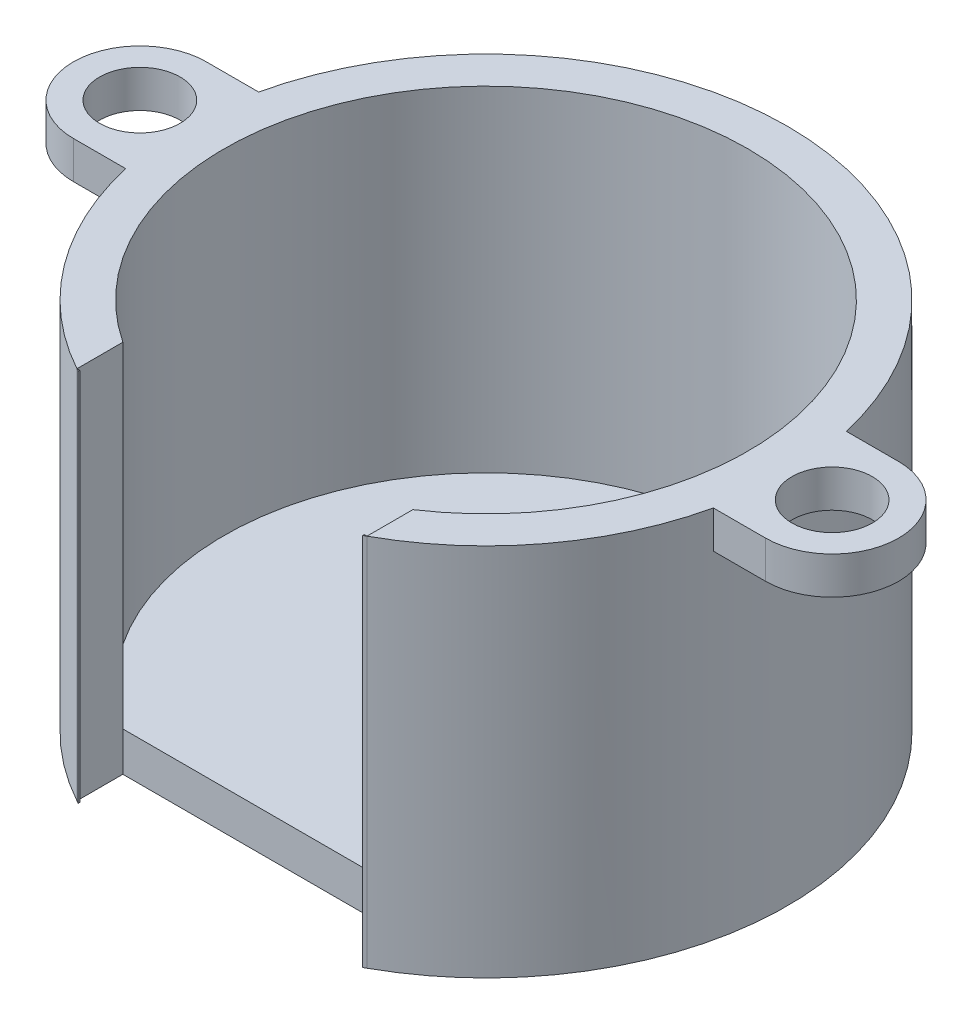
ISO-10303-21;
HEADER;
FILE_DESCRIPTION(('STEP AP214'),'2;1');
FILE_NAME('part.step','',(''),(''),'','','');
FILE_SCHEMA(('AUTOMOTIVE_DESIGN { 1 0 10303 214 1 1 1 1 }'));
ENDSEC;
DATA;
#1=APPLICATION_CONTEXT('core data for automotive mechanical design processes');
#2=APPLICATION_PROTOCOL_DEFINITION('international standard','automotive_design',2000,#1);
#3=PRODUCT_CONTEXT('',#1,'mechanical');
#4=PRODUCT('Part','Part','',(#3));
#5=PRODUCT_RELATED_PRODUCT_CATEGORY('part','',(#4));
#6=PRODUCT_DEFINITION_FORMATION('','',#4);
#7=PRODUCT_DEFINITION_CONTEXT('part definition',#1,'design');
#8=PRODUCT_DEFINITION('design','',#6,#7);
#9=PRODUCT_DEFINITION_SHAPE('','',#8);
#10=(LENGTH_UNIT() NAMED_UNIT(*) SI_UNIT(.MILLI.,.METRE.));
#11=(NAMED_UNIT(*) PLANE_ANGLE_UNIT() SI_UNIT($,.RADIAN.));
#12=(NAMED_UNIT(*) SI_UNIT($,.STERADIAN.) SOLID_ANGLE_UNIT());
#13=UNCERTAINTY_MEASURE_WITH_UNIT(LENGTH_MEASURE(1.E-05),#10,'distance_accuracy_value','');
#14=(GEOMETRIC_REPRESENTATION_CONTEXT(3) GLOBAL_UNCERTAINTY_ASSIGNED_CONTEXT((#13)) GLOBAL_UNIT_ASSIGNED_CONTEXT((#10,
#11,#12)) REPRESENTATION_CONTEXT('',''));
#15=CARTESIAN_POINT('',(0.,0.,0.));
#16=DIRECTION('',(0.,0.,1.));
#17=DIRECTION('',(1.,0.,0.));
#18=AXIS2_PLACEMENT_3D('',#15,#16,#17);
#19=CARTESIAN_POINT('',(0.,20.,0.));
#20=DIRECTION('',(0.,1.,0.));
#21=DIRECTION('',(0.,0.,1.));
#22=AXIS2_PLACEMENT_3D('',#19,#20,#21);
#23=PLANE('',#22);
#24=DIRECTION('',(0.,0.,1.));
#25=VECTOR('',#24,1.);
#26=CARTESIAN_POINT('',(-7.6,20.,-16.101));
#27=LINE('',#26,#25);
#28=CARTESIAN_POINT('',(-7.6,20.,14.1119630101556));
#29=VERTEX_POINT('',#28);
#30=CARTESIAN_POINT('',(-7.6,20.,14.1933082824266));
#31=VERTEX_POINT('',#30);
#32=EDGE_CURVE('E66',#29,#31,#27,.T.);
#33=ORIENTED_EDGE('',*,*,#32,.F.);
#34=DIRECTION('',(1.,0.,0.));
#35=VECTOR('',#34,1.);
#36=CARTESIAN_POINT('',(-7.75,20.,14.1119630101556));
#37=LINE('',#36,#35);
#38=CARTESIAN_POINT('',(-7.75,20.,14.1119630101556));
#39=VERTEX_POINT('',#38);
#40=EDGE_CURVE('E60',#39,#29,#37,.T.);
#41=ORIENTED_EDGE('',*,*,#40,.F.);
#42=CARTESIAN_POINT('',(0.,20.,0.));
#43=DIRECTION('',(0.,1.,0.));
#44=DIRECTION('',(0.,0.,1.));
#45=AXIS2_PLACEMENT_3D('',#42,#43,#44);
#46=CIRCLE('',#45,16.1);
#47=EDGE_CURVE('E95',#39,#31,#46,.T.);
#48=ORIENTED_EDGE('',*,*,#47,.T.);
#49=EDGE_LOOP('',(#33,#41,#48));
#50=FACE_BOUND('',#49,.T.);
#51=ADVANCED_FACE('F57',(#50),#23,.T.);
#52=CARTESIAN_POINT('',(0.,0.,0.));
#53=DIRECTION('',(0.,1.,0.));
#54=DIRECTION('',(0.,0.,1.));
#55=AXIS2_PLACEMENT_3D('',#52,#53,#54);
#56=PLANE('',#55);
#57=DIRECTION('',(1.,0.,0.));
#58=VECTOR('',#57,1.);
#59=CARTESIAN_POINT('',(-7.75,0.,14.1119630101556));
#60=LINE('',#59,#58);
#61=CARTESIAN_POINT('',(-7.75,0.,14.1119630101556));
#62=VERTEX_POINT('',#61);
#63=CARTESIAN_POINT('',(-7.6,0.,14.1119630101556));
#64=VERTEX_POINT('',#63);
#65=EDGE_CURVE('E98',#62,#64,#60,.T.);
#66=ORIENTED_EDGE('',*,*,#65,.T.);
#67=DIRECTION('',(0.,0.,1.));
#68=VECTOR('',#67,1.);
#69=CARTESIAN_POINT('',(-7.6,0.,-16.101));
#70=LINE('',#69,#68);
#71=CARTESIAN_POINT('',(-7.6,0.,14.1933082824266));
#72=VERTEX_POINT('',#71);
#73=EDGE_CURVE('E73',#64,#72,#70,.T.);
#74=ORIENTED_EDGE('',*,*,#73,.T.);
#75=CARTESIAN_POINT('',(0.,0.,0.));
#76=DIRECTION('',(0.,1.,0.));
#77=DIRECTION('',(0.,0.,1.));
#78=AXIS2_PLACEMENT_3D('',#75,#76,#77);
#79=CIRCLE('',#78,16.1);
#80=EDGE_CURVE('E103',#62,#72,#79,.T.);
#81=ORIENTED_EDGE('',*,*,#80,.F.);
#82=EDGE_LOOP('',(#66,#74,#81));
#83=FACE_BOUND('',#82,.T.);
#84=ADVANCED_FACE('F114',(#83),#56,.F.);
#85=CARTESIAN_POINT('',(-7.75,0.,14.1119630101556));
#86=DIRECTION('',(0.,0.,1.));
#87=DIRECTION('',(1.,0.,0.));
#88=AXIS2_PLACEMENT_3D('',#85,#86,#87);
#89=PLANE('',#88);
#90=ORIENTED_EDGE('',*,*,#40,.T.);
#91=DIRECTION('',(0.,1.,0.));
#92=VECTOR('',#91,1.);
#93=CARTESIAN_POINT('',(-7.6,20.,14.1119630101556));
#94=LINE('',#93,#92);
#95=EDGE_CURVE('E89',#64,#29,#94,.T.);
#96=ORIENTED_EDGE('',*,*,#95,.F.);
#97=ORIENTED_EDGE('',*,*,#65,.F.);
#98=DIRECTION('',(0.,1.,0.));
#99=VECTOR('',#98,1.);
#100=CARTESIAN_POINT('',(-7.75,0.,14.1119630101556));
#101=LINE('',#100,#99);
#102=EDGE_CURVE('E104',#62,#39,#101,.T.);
#103=ORIENTED_EDGE('',*,*,#102,.T.);
#104=EDGE_LOOP('',(#90,#96,#97,#103));
#105=FACE_BOUND('',#104,.T.);
#106=ADVANCED_FACE('F112',(#105),#89,.F.);
#107=CARTESIAN_POINT('',(0.,20.,0.));
#108=DIRECTION('',(0.,-1.,0.));
#109=DIRECTION('',(0.,0.,-1.));
#110=AXIS2_PLACEMENT_3D('',#107,#108,#109);
#111=CYLINDRICAL_SURFACE('',#110,16.1);
#112=ORIENTED_EDGE('',*,*,#47,.F.);
#113=ORIENTED_EDGE('',*,*,#102,.F.);
#114=ORIENTED_EDGE('',*,*,#80,.T.);
#115=DIRECTION('',(0.,-1.,0.));
#116=VECTOR('',#115,1.);
#117=CARTESIAN_POINT('',(-7.6,20.,14.1933082824266));
#118=LINE('',#117,#116);
#119=EDGE_CURVE('E12',#31,#72,#118,.T.);
#120=ORIENTED_EDGE('',*,*,#119,.F.);
#121=EDGE_LOOP('',(#112,#113,#114,#120));
#122=FACE_BOUND('',#121,.T.);
#123=ADVANCED_FACE('F101',(#122),#111,.T.);
#124=CARTESIAN_POINT('',(-7.6,20.,-16.101));
#125=DIRECTION('',(-1.,0.,0.));
#126=DIRECTION('',(0.,0.,1.));
#127=AXIS2_PLACEMENT_3D('',#124,#125,#126);
#128=PLANE('',#127);
#129=ORIENTED_EDGE('',*,*,#95,.T.);
#130=ORIENTED_EDGE('',*,*,#32,.T.);
#131=ORIENTED_EDGE('',*,*,#119,.T.);
#132=ORIENTED_EDGE('',*,*,#73,.F.);
#133=EDGE_LOOP('',(#129,#130,#131,#132));
#134=FACE_BOUND('',#133,.T.);
#135=ADVANCED_FACE('F87',(#134),#128,.F.);
#136=CLOSED_SHELL('',(#51,#84,#106,#123,#135));
#137=MANIFOLD_SOLID_BREP('B2',#136);
#138=CARTESIAN_POINT('',(0.,20.,0.));
#139=DIRECTION('',(0.,-1.,0.));
#140=DIRECTION('',(0.,0.,-1.));
#141=AXIS2_PLACEMENT_3D('',#138,#139,#140);
#142=CYLINDRICAL_SURFACE('',#141,16.1);
#143=DIRECTION('',(0.,-1.,0.));
#144=VECTOR('',#143,1.);
#145=CARTESIAN_POINT('',(-7.75,20.,14.1119630101556));
#146=LINE('',#145,#144);
#147=CARTESIAN_POINT('',(-7.75,20.,14.1119630101556));
#148=VERTEX_POINT('',#147);
#149=CARTESIAN_POINT('',(-7.75,0.,14.1119630101556));
#150=VERTEX_POINT('',#149);
#151=EDGE_CURVE('E350',#148,#150,#146,.T.);
#152=ORIENTED_EDGE('',*,*,#151,.F.);
#153=CARTESIAN_POINT('',(0.,20.,0.));
#154=DIRECTION('',(0.,1.,0.));
#155=DIRECTION('',(0.,0.,1.));
#156=AXIS2_PLACEMENT_3D('',#153,#154,#155);
#157=CIRCLE('',#156,16.1);
#158=CARTESIAN_POINT('',(-15.7037415923722,20.,3.55));
#159=VERTEX_POINT('',#158);
#160=EDGE_CURVE('E340',#159,#148,#157,.T.);
#161=ORIENTED_EDGE('',*,*,#160,.F.);
#162=DIRECTION('',(0.,1.,0.));
#163=VECTOR('',#162,1.);
#164=CARTESIAN_POINT('',(-15.7037415923722,18.,3.55));
#165=LINE('',#164,#163);
#166=CARTESIAN_POINT('',(-15.7037415923722,18.,3.55));
#167=VERTEX_POINT('',#166);
#168=EDGE_CURVE('E379',#167,#159,#165,.T.);
#169=ORIENTED_EDGE('',*,*,#168,.F.);
#170=CARTESIAN_POINT('',(0.,18.,0.));
#171=DIRECTION('',(0.,1.,0.));
#172=DIRECTION('',(0.,0.,1.));
#173=AXIS2_PLACEMENT_3D('',#170,#171,#172);
#174=CIRCLE('',#173,16.1);
#175=CARTESIAN_POINT('',(-15.7037415923722,18.,-3.55));
#176=VERTEX_POINT('',#175);
#177=EDGE_CURVE('E322',#176,#167,#174,.T.);
#178=ORIENTED_EDGE('',*,*,#177,.F.);
#179=DIRECTION('',(0.,1.,0.));
#180=VECTOR('',#179,1.);
#181=CARTESIAN_POINT('',(-15.7037415923722,18.,-3.55));
#182=LINE('',#181,#180);
#183=CARTESIAN_POINT('',(-15.7037415923722,20.,-3.55));
#184=VERTEX_POINT('',#183);
#185=EDGE_CURVE('E408',#176,#184,#182,.T.);
#186=ORIENTED_EDGE('',*,*,#185,.T.);
#187=CARTESIAN_POINT('',(15.7037415923722,20.,-3.55));
#188=VERTEX_POINT('',#187);
#189=EDGE_CURVE('E318',#188,#184,#157,.T.);
#190=ORIENTED_EDGE('',*,*,#189,.F.);
#191=DIRECTION('',(0.,1.,0.));
#192=VECTOR('',#191,1.);
#193=CARTESIAN_POINT('',(15.7037415923722,18.,-3.55));
#194=LINE('',#193,#192);
#195=CARTESIAN_POINT('',(15.7037415923722,18.,-3.55));
#196=VERTEX_POINT('',#195);
#197=EDGE_CURVE('E305',#196,#188,#194,.T.);
#198=ORIENTED_EDGE('',*,*,#197,.F.);
#199=CARTESIAN_POINT('',(0.,18.,0.));
#200=DIRECTION('',(0.,1.,0.));
#201=DIRECTION('',(0.,0.,1.));
#202=AXIS2_PLACEMENT_3D('',#199,#200,#201);
#203=CIRCLE('',#202,16.1);
#204=CARTESIAN_POINT('',(15.7037415923722,18.,3.55));
#205=VERTEX_POINT('',#204);
#206=EDGE_CURVE('E215',#205,#196,#203,.T.);
#207=ORIENTED_EDGE('',*,*,#206,.F.);
#208=DIRECTION('',(0.,1.,0.));
#209=VECTOR('',#208,1.);
#210=CARTESIAN_POINT('',(15.7037415923722,18.,3.55));
#211=LINE('',#210,#209);
#212=CARTESIAN_POINT('',(15.7037415923722,20.,3.55));
#213=VERTEX_POINT('',#212);
#214=EDGE_CURVE('E285',#205,#213,#211,.T.);
#215=ORIENTED_EDGE('',*,*,#214,.T.);
#216=CARTESIAN_POINT('',(7.75,20.,14.1119630101556));
#217=VERTEX_POINT('',#216);
#218=EDGE_CURVE('E319',#217,#213,#157,.T.);
#219=ORIENTED_EDGE('',*,*,#218,.F.);
#220=DIRECTION('',(0.,-1.,0.));
#221=VECTOR('',#220,1.);
#222=CARTESIAN_POINT('',(7.75,20.,14.1119630101556));
#223=LINE('',#222,#221);
#224=CARTESIAN_POINT('',(7.75,0.,14.1119630101556));
#225=VERTEX_POINT('',#224);
#226=EDGE_CURVE('E235',#225,#217,#223,.F.);
#227=ORIENTED_EDGE('',*,*,#226,.F.);
#228=CARTESIAN_POINT('',(0.,0.,0.));
#229=DIRECTION('',(0.,1.,0.));
#230=DIRECTION('',(0.,0.,1.));
#231=AXIS2_PLACEMENT_3D('',#228,#229,#230);
#232=CIRCLE('',#231,16.1);
#233=EDGE_CURVE('E172',#225,#150,#232,.T.);
#234=ORIENTED_EDGE('',*,*,#233,.T.);
#235=EDGE_LOOP('',(#152,#161,#169,#178,#186,#190,#198,#207,#215,#219,#227,#234));
#236=FACE_BOUND('',#235,.T.);
#237=ADVANCED_FACE('F169',(#236),#142,.T.);
#238=CARTESIAN_POINT('',(0.,20.,0.));
#239=DIRECTION('',(0.,1.,0.));
#240=DIRECTION('',(0.,0.,1.));
#241=AXIS2_PLACEMENT_3D('',#238,#239,#240);
#242=PLANE('',#241);
#243=CARTESIAN_POINT('',(-18.5,20.,0.));
#244=DIRECTION('',(0.,1.,0.));
#245=DIRECTION('',(0.,0.,1.));
#246=AXIS2_PLACEMENT_3D('',#243,#244,#245);
#247=CIRCLE('',#246,2.15);
#248=CARTESIAN_POINT('',(-18.5,20.,2.15));
#249=VERTEX_POINT('',#248);
#250=EDGE_CURVE('E374',#249,#249,#247,.T.);
#251=ORIENTED_EDGE('',*,*,#250,.F.);
#252=EDGE_LOOP('',(#251));
#253=FACE_BOUND('',#252,.T.);
#254=CARTESIAN_POINT('',(18.5,20.,0.));
#255=DIRECTION('',(0.,1.,0.));
#256=DIRECTION('',(0.,0.,1.));
#257=AXIS2_PLACEMENT_3D('',#254,#255,#256);
#258=CIRCLE('',#257,2.15);
#259=CARTESIAN_POINT('',(18.5,20.,2.15));
#260=VERTEX_POINT('',#259);
#261=EDGE_CURVE('E295',#260,#260,#258,.T.);
#262=ORIENTED_EDGE('',*,*,#261,.F.);
#263=EDGE_LOOP('',(#262));
#264=FACE_BOUND('',#263,.T.);
#265=ORIENTED_EDGE('',*,*,#160,.T.);
#266=DIRECTION('',(0.,0.,-1.));
#267=VECTOR('',#266,1.);
#268=CARTESIAN_POINT('',(-7.75,20.,14.1119630101556));
#269=LINE('',#268,#267);
#270=CARTESIAN_POINT('',(-7.75,20.,11.659223816361));
#271=VERTEX_POINT('',#270);
#272=EDGE_CURVE('E227',#148,#271,#269,.T.);
#273=ORIENTED_EDGE('',*,*,#272,.T.);
#274=CARTESIAN_POINT('',(0.,20.,0.));
#275=DIRECTION('',(0.,1.,0.));
#276=DIRECTION('',(0.,0.,1.));
#277=AXIS2_PLACEMENT_3D('',#274,#275,#276);
#278=CIRCLE('',#277,14.);
#279=CARTESIAN_POINT('',(7.75,20.,11.659223816361));
#280=VERTEX_POINT('',#279);
#281=EDGE_CURVE('E345',#280,#271,#278,.T.);
#282=ORIENTED_EDGE('',*,*,#281,.F.);
#283=DIRECTION('',(0.,0.,-1.));
#284=VECTOR('',#283,1.);
#285=CARTESIAN_POINT('',(7.75,20.,14.1119630101556));
#286=LINE('',#285,#284);
#287=EDGE_CURVE('E334',#217,#280,#286,.T.);
#288=ORIENTED_EDGE('',*,*,#287,.F.);
#289=ORIENTED_EDGE('',*,*,#218,.T.);
#290=DIRECTION('',(-1.,0.,0.));
#291=VECTOR('',#290,1.);
#292=CARTESIAN_POINT('',(0.,20.,3.55));
#293=LINE('',#292,#291);
#294=CARTESIAN_POINT('',(18.5,20.,3.55));
#295=VERTEX_POINT('',#294);
#296=EDGE_CURVE('E301',#295,#213,#293,.T.);
#297=ORIENTED_EDGE('',*,*,#296,.F.);
#298=CARTESIAN_POINT('',(18.5,20.,0.));
#299=DIRECTION('',(0.,1.,0.));
#300=DIRECTION('',(0.,0.,1.));
#301=AXIS2_PLACEMENT_3D('',#298,#299,#300);
#302=CIRCLE('',#301,3.55);
#303=CARTESIAN_POINT('',(18.5,20.,-3.55));
#304=VERTEX_POINT('',#303);
#305=EDGE_CURVE('E299',#304,#295,#302,.F.);
#306=ORIENTED_EDGE('',*,*,#305,.F.);
#307=DIRECTION('',(-1.,0.,0.));
#308=VECTOR('',#307,1.);
#309=CARTESIAN_POINT('',(0.,20.,-3.55));
#310=LINE('',#309,#308);
#311=EDGE_CURVE('E315',#304,#188,#310,.T.);
#312=ORIENTED_EDGE('',*,*,#311,.T.);
#313=ORIENTED_EDGE('',*,*,#189,.T.);
#314=DIRECTION('',(1.,0.,0.));
#315=VECTOR('',#314,1.);
#316=CARTESIAN_POINT('',(0.,20.,-3.55));
#317=LINE('',#316,#315);
#318=CARTESIAN_POINT('',(-18.5,20.,-3.55));
#319=VERTEX_POINT('',#318);
#320=EDGE_CURVE('E369',#319,#184,#317,.T.);
#321=ORIENTED_EDGE('',*,*,#320,.F.);
#322=CARTESIAN_POINT('',(-18.5,20.,0.));
#323=DIRECTION('',(0.,1.,0.));
#324=DIRECTION('',(0.,0.,1.));
#325=AXIS2_PLACEMENT_3D('',#322,#323,#324);
#326=CIRCLE('',#325,3.55);
#327=CARTESIAN_POINT('',(-18.5,20.,3.55));
#328=VERTEX_POINT('',#327);
#329=EDGE_CURVE('E357',#319,#328,#326,.T.);
#330=ORIENTED_EDGE('',*,*,#329,.T.);
#331=DIRECTION('',(1.,0.,0.));
#332=VECTOR('',#331,1.);
#333=CARTESIAN_POINT('',(0.,20.,3.55));
#334=LINE('',#333,#332);
#335=EDGE_CURVE('E346',#328,#159,#334,.T.);
#336=ORIENTED_EDGE('',*,*,#335,.T.);
#337=EDGE_LOOP('',(#265,#273,#282,#288,#289,#297,#306,#312,#313,#321,#330,#336));
#338=FACE_BOUND('',#337,.T.);
#339=ADVANCED_FACE('F464',(#253,#264,#338),#242,.T.);
#340=CARTESIAN_POINT('',(0.,0.,0.));
#341=DIRECTION('',(0.,1.,0.));
#342=DIRECTION('',(0.,0.,1.));
#343=AXIS2_PLACEMENT_3D('',#340,#341,#342);
#344=PLANE('',#343);
#345=DIRECTION('',(0.,0.,-1.));
#346=VECTOR('',#345,1.);
#347=CARTESIAN_POINT('',(-7.75,0.,14.1119630101556));
#348=LINE('',#347,#346);
#349=CARTESIAN_POINT('',(-7.75,0.,11.659223816361));
#350=VERTEX_POINT('',#349);
#351=EDGE_CURVE('E330',#150,#350,#348,.T.);
#352=ORIENTED_EDGE('',*,*,#351,.F.);
#353=ORIENTED_EDGE('',*,*,#233,.F.);
#354=DIRECTION('',(0.,0.,-1.));
#355=VECTOR('',#354,1.);
#356=CARTESIAN_POINT('',(7.75,0.,14.1119630101556));
#357=LINE('',#356,#355);
#358=CARTESIAN_POINT('',(7.75,0.,11.659223816361));
#359=VERTEX_POINT('',#358);
#360=EDGE_CURVE('E341',#225,#359,#357,.T.);
#361=ORIENTED_EDGE('',*,*,#360,.T.);
#362=DIRECTION('',(1.,0.,0.));
#363=VECTOR('',#362,1.);
#364=CARTESIAN_POINT('',(-7.75,0.,11.659223816361));
#365=LINE('',#364,#363);
#366=EDGE_CURVE('E204',#350,#359,#365,.T.);
#367=ORIENTED_EDGE('',*,*,#366,.F.);
#368=EDGE_LOOP('',(#352,#353,#361,#367));
#369=FACE_BOUND('',#368,.T.);
#370=ADVANCED_FACE('F442',(#369),#344,.F.);
#371=CARTESIAN_POINT('',(0.,20.,0.));
#372=DIRECTION('',(0.,-1.,0.));
#373=DIRECTION('',(0.,0.,-1.));
#374=AXIS2_PLACEMENT_3D('',#371,#372,#373);
#375=CYLINDRICAL_SURFACE('',#374,14.);
#376=ORIENTED_EDGE('',*,*,#281,.T.);
#377=DIRECTION('',(0.,1.,0.));
#378=VECTOR('',#377,1.);
#379=CARTESIAN_POINT('',(-7.75,0.,11.659223816361));
#380=LINE('',#379,#378);
#381=CARTESIAN_POINT('',(-7.75,2.1,11.659223816361));
#382=VERTEX_POINT('',#381);
#383=EDGE_CURVE('E55',#382,#271,#380,.T.);
#384=ORIENTED_EDGE('',*,*,#383,.F.);
#385=CARTESIAN_POINT('',(0.,2.1,0.));
#386=DIRECTION('',(0.,1.,0.));
#387=DIRECTION('',(0.,0.,1.));
#388=AXIS2_PLACEMENT_3D('',#385,#386,#387);
#389=CIRCLE('',#388,14.);
#390=CARTESIAN_POINT('',(7.75,2.1,11.659223816361));
#391=VERTEX_POINT('',#390);
#392=EDGE_CURVE('E422',#391,#382,#389,.T.);
#393=ORIENTED_EDGE('',*,*,#392,.F.);
#394=DIRECTION('',(0.,1.,0.));
#395=VECTOR('',#394,1.);
#396=CARTESIAN_POINT('',(7.75,0.,11.659223816361));
#397=LINE('',#396,#395);
#398=EDGE_CURVE('E335',#391,#280,#397,.T.);
#399=ORIENTED_EDGE('',*,*,#398,.T.);
#400=EDGE_LOOP('',(#376,#384,#393,#399));
#401=FACE_BOUND('',#400,.T.);
#402=ADVANCED_FACE('F450',(#401),#375,.F.);
#403=CARTESIAN_POINT('',(0.,2.1,0.));
#404=DIRECTION('',(0.,1.,0.));
#405=DIRECTION('',(0.,0.,1.));
#406=AXIS2_PLACEMENT_3D('',#403,#404,#405);
#407=PLANE('',#406);
#408=ORIENTED_EDGE('',*,*,#392,.T.);
#409=DIRECTION('',(1.,0.,0.));
#410=VECTOR('',#409,1.);
#411=CARTESIAN_POINT('',(0.,2.1,11.659223816361));
#412=LINE('',#411,#410);
#413=EDGE_CURVE('E373',#382,#391,#412,.T.);
#414=ORIENTED_EDGE('',*,*,#413,.T.);
#415=EDGE_LOOP('',(#408,#414));
#416=FACE_BOUND('',#415,.T.);
#417=ADVANCED_FACE('F452',(#416),#407,.T.);
#418=CARTESIAN_POINT('',(0.,18.,-3.55));
#419=DIRECTION('',(0.,0.,1.));
#420=DIRECTION('',(1.,0.,0.));
#421=AXIS2_PLACEMENT_3D('',#418,#419,#420);
#422=PLANE('',#421);
#423=ORIENTED_EDGE('',*,*,#320,.T.);
#424=ORIENTED_EDGE('',*,*,#185,.F.);
#425=DIRECTION('',(1.,0.,0.));
#426=VECTOR('',#425,1.);
#427=CARTESIAN_POINT('',(0.,18.,-3.55));
#428=LINE('',#427,#426);
#429=CARTESIAN_POINT('',(-18.5,18.,-3.55));
#430=VERTEX_POINT('',#429);
#431=EDGE_CURVE('E382',#430,#176,#428,.T.);
#432=ORIENTED_EDGE('',*,*,#431,.F.);
#433=DIRECTION('',(0.,1.,0.));
#434=VECTOR('',#433,1.);
#435=CARTESIAN_POINT('',(-18.5,18.,-3.55));
#436=LINE('',#435,#434);
#437=EDGE_CURVE('E372',#430,#319,#436,.T.);
#438=ORIENTED_EDGE('',*,*,#437,.T.);
#439=EDGE_LOOP('',(#423,#424,#432,#438));
#440=FACE_BOUND('',#439,.T.);
#441=ADVANCED_FACE('F454',(#440),#422,.F.);
#442=CARTESIAN_POINT('',(0.,18.,3.55));
#443=DIRECTION('',(0.,0.,1.));
#444=DIRECTION('',(1.,0.,0.));
#445=AXIS2_PLACEMENT_3D('',#442,#443,#444);
#446=PLANE('',#445);
#447=ORIENTED_EDGE('',*,*,#335,.F.);
#448=DIRECTION('',(0.,1.,0.));
#449=VECTOR('',#448,1.);
#450=CARTESIAN_POINT('',(-18.5,18.,3.55));
#451=LINE('',#450,#449);
#452=CARTESIAN_POINT('',(-18.5,18.,3.55));
#453=VERTEX_POINT('',#452);
#454=EDGE_CURVE('E390',#453,#328,#451,.T.);
#455=ORIENTED_EDGE('',*,*,#454,.F.);
#456=DIRECTION('',(1.,0.,0.));
#457=VECTOR('',#456,1.);
#458=CARTESIAN_POINT('',(0.,18.,3.55));
#459=LINE('',#458,#457);
#460=EDGE_CURVE('E383',#453,#167,#459,.T.);
#461=ORIENTED_EDGE('',*,*,#460,.T.);
#462=ORIENTED_EDGE('',*,*,#168,.T.);
#463=EDGE_LOOP('',(#447,#455,#461,#462));
#464=FACE_BOUND('',#463,.T.);
#465=ADVANCED_FACE('F460',(#464),#446,.T.);
#466=CARTESIAN_POINT('',(-18.5,18.,0.));
#467=DIRECTION('',(0.,1.,0.));
#468=DIRECTION('',(0.,0.,1.));
#469=AXIS2_PLACEMENT_3D('',#466,#467,#468);
#470=CYLINDRICAL_SURFACE('',#469,2.15);
#471=CARTESIAN_POINT('',(-18.5,18.,0.));
#472=DIRECTION('',(0.,1.,0.));
#473=DIRECTION('',(0.,0.,1.));
#474=AXIS2_PLACEMENT_3D('',#471,#472,#473);
#475=CIRCLE('',#474,2.15);
#476=CARTESIAN_POINT('',(-18.5,18.,2.15));
#477=VERTEX_POINT('',#476);
#478=EDGE_CURVE('E393',#477,#477,#475,.T.);
#479=ORIENTED_EDGE('',*,*,#478,.F.);
#480=EDGE_LOOP('',(#479));
#481=FACE_BOUND('',#480,.T.);
#482=ORIENTED_EDGE('',*,*,#250,.T.);
#483=EDGE_LOOP('',(#482));
#484=FACE_BOUND('',#483,.T.);
#485=ADVANCED_FACE('F501',(#481,#484),#470,.F.);
#486=CARTESIAN_POINT('',(-18.5,18.,0.));
#487=DIRECTION('',(0.,1.,0.));
#488=DIRECTION('',(0.,0.,1.));
#489=AXIS2_PLACEMENT_3D('',#486,#487,#488);
#490=CYLINDRICAL_SURFACE('',#489,3.55);
#491=ORIENTED_EDGE('',*,*,#329,.F.);
#492=ORIENTED_EDGE('',*,*,#437,.F.);
#493=CARTESIAN_POINT('',(-18.5,18.,0.));
#494=DIRECTION('',(0.,1.,0.));
#495=DIRECTION('',(0.,0.,1.));
#496=AXIS2_PLACEMENT_3D('',#493,#494,#495);
#497=CIRCLE('',#496,3.55);
#498=EDGE_CURVE('E378',#430,#453,#497,.T.);
#499=ORIENTED_EDGE('',*,*,#498,.T.);
#500=ORIENTED_EDGE('',*,*,#454,.T.);
#501=EDGE_LOOP('',(#491,#492,#499,#500));
#502=FACE_BOUND('',#501,.T.);
#503=ADVANCED_FACE('F497',(#502),#490,.T.);
#504=CARTESIAN_POINT('',(0.,18.,0.));
#505=DIRECTION('',(0.,1.,0.));
#506=DIRECTION('',(0.,0.,1.));
#507=AXIS2_PLACEMENT_3D('',#504,#505,#506);
#508=PLANE('',#507);
#509=ORIENTED_EDGE('',*,*,#478,.T.);
#510=EDGE_LOOP('',(#509));
#511=FACE_BOUND('',#510,.T.);
#512=ORIENTED_EDGE('',*,*,#431,.T.);
#513=ORIENTED_EDGE('',*,*,#177,.T.);
#514=ORIENTED_EDGE('',*,*,#460,.F.);
#515=ORIENTED_EDGE('',*,*,#498,.F.);
#516=EDGE_LOOP('',(#512,#513,#514,#515));
#517=FACE_BOUND('',#516,.T.);
#518=ADVANCED_FACE('F494',(#511,#517),#508,.F.);
#519=CARTESIAN_POINT('',(18.5,18.,0.));
#520=DIRECTION('',(0.,1.,0.));
#521=DIRECTION('',(0.,0.,1.));
#522=AXIS2_PLACEMENT_3D('',#519,#520,#521);
#523=CYLINDRICAL_SURFACE('',#522,3.55);
#524=ORIENTED_EDGE('',*,*,#305,.T.);
#525=DIRECTION('',(0.,1.,0.));
#526=VECTOR('',#525,1.);
#527=CARTESIAN_POINT('',(18.5,18.,3.55));
#528=LINE('',#527,#526);
#529=CARTESIAN_POINT('',(18.5,18.,3.55));
#530=VERTEX_POINT('',#529);
#531=EDGE_CURVE('E282',#530,#295,#528,.T.);
#532=ORIENTED_EDGE('',*,*,#531,.F.);
#533=CARTESIAN_POINT('',(18.5,18.,0.));
#534=DIRECTION('',(0.,1.,0.));
#535=DIRECTION('',(0.,0.,1.));
#536=AXIS2_PLACEMENT_3D('',#533,#534,#535);
#537=CIRCLE('',#536,3.55);
#538=CARTESIAN_POINT('',(18.5,18.,-3.55));
#539=VERTEX_POINT('',#538);
#540=EDGE_CURVE('E287',#539,#530,#537,.F.);
#541=ORIENTED_EDGE('',*,*,#540,.F.);
#542=DIRECTION('',(0.,1.,0.));
#543=VECTOR('',#542,1.);
#544=CARTESIAN_POINT('',(18.5,18.,-3.55));
#545=LINE('',#544,#543);
#546=EDGE_CURVE('E307',#539,#304,#545,.T.);
#547=ORIENTED_EDGE('',*,*,#546,.T.);
#548=EDGE_LOOP('',(#524,#532,#541,#547));
#549=FACE_BOUND('',#548,.T.);
#550=ADVANCED_FACE('F297',(#549),#523,.T.);
#551=CARTESIAN_POINT('',(0.,18.,3.55));
#552=DIRECTION('',(0.,0.,-1.));
#553=DIRECTION('',(-1.,0.,0.));
#554=AXIS2_PLACEMENT_3D('',#551,#552,#553);
#555=PLANE('',#554);
#556=ORIENTED_EDGE('',*,*,#296,.T.);
#557=ORIENTED_EDGE('',*,*,#214,.F.);
#558=DIRECTION('',(-1.,0.,0.));
#559=VECTOR('',#558,1.);
#560=CARTESIAN_POINT('',(0.,18.,3.55));
#561=LINE('',#560,#559);
#562=EDGE_CURVE('E277',#530,#205,#561,.T.);
#563=ORIENTED_EDGE('',*,*,#562,.F.);
#564=ORIENTED_EDGE('',*,*,#531,.T.);
#565=EDGE_LOOP('',(#556,#557,#563,#564));
#566=FACE_BOUND('',#565,.T.);
#567=ADVANCED_FACE('F280',(#566),#555,.F.);
#568=CARTESIAN_POINT('',(0.,18.,-3.55));
#569=DIRECTION('',(0.,0.,-1.));
#570=DIRECTION('',(-1.,0.,0.));
#571=AXIS2_PLACEMENT_3D('',#568,#569,#570);
#572=PLANE('',#571);
#573=ORIENTED_EDGE('',*,*,#311,.F.);
#574=ORIENTED_EDGE('',*,*,#546,.F.);
#575=DIRECTION('',(-1.,0.,0.));
#576=VECTOR('',#575,1.);
#577=CARTESIAN_POINT('',(0.,18.,-3.55));
#578=LINE('',#577,#576);
#579=EDGE_CURVE('E292',#539,#196,#578,.T.);
#580=ORIENTED_EDGE('',*,*,#579,.T.);
#581=ORIENTED_EDGE('',*,*,#197,.T.);
#582=EDGE_LOOP('',(#573,#574,#580,#581));
#583=FACE_BOUND('',#582,.T.);
#584=ADVANCED_FACE('F403',(#583),#572,.T.);
#585=CARTESIAN_POINT('',(18.5,18.,0.));
#586=DIRECTION('',(0.,1.,0.));
#587=DIRECTION('',(0.,0.,1.));
#588=AXIS2_PLACEMENT_3D('',#585,#586,#587);
#589=CYLINDRICAL_SURFACE('',#588,2.15);
#590=CARTESIAN_POINT('',(18.5,18.,0.));
#591=DIRECTION('',(0.,1.,0.));
#592=DIRECTION('',(0.,0.,1.));
#593=AXIS2_PLACEMENT_3D('',#590,#591,#592);
#594=CIRCLE('',#593,2.15);
#595=CARTESIAN_POINT('',(18.5,18.,2.15));
#596=VERTEX_POINT('',#595);
#597=EDGE_CURVE('E323',#596,#596,#594,.T.);
#598=ORIENTED_EDGE('',*,*,#597,.F.);
#599=EDGE_LOOP('',(#598));
#600=FACE_BOUND('',#599,.T.);
#601=ORIENTED_EDGE('',*,*,#261,.T.);
#602=EDGE_LOOP('',(#601));
#603=FACE_BOUND('',#602,.T.);
#604=ADVANCED_FACE('F484',(#600,#603),#589,.F.);
#605=CARTESIAN_POINT('',(0.,18.,0.));
#606=DIRECTION('',(0.,1.,0.));
#607=DIRECTION('',(0.,0.,1.));
#608=AXIS2_PLACEMENT_3D('',#605,#606,#607);
#609=PLANE('',#608);
#610=ORIENTED_EDGE('',*,*,#540,.T.);
#611=ORIENTED_EDGE('',*,*,#562,.T.);
#612=ORIENTED_EDGE('',*,*,#206,.T.);
#613=ORIENTED_EDGE('',*,*,#579,.F.);
#614=EDGE_LOOP('',(#610,#611,#612,#613));
#615=FACE_BOUND('',#614,.T.);
#616=ORIENTED_EDGE('',*,*,#597,.T.);
#617=EDGE_LOOP('',(#616));
#618=FACE_BOUND('',#617,.T.);
#619=ADVANCED_FACE('F290',(#615,#618),#609,.F.);
#620=CARTESIAN_POINT('',(-7.75,0.,11.659223816361));
#621=DIRECTION('',(0.,0.,1.));
#622=DIRECTION('',(1.,0.,0.));
#623=AXIS2_PLACEMENT_3D('',#620,#621,#622);
#624=PLANE('',#623);
#625=EDGE_CURVE('E179',#350,#382,#380,.T.);
#626=ORIENTED_EDGE('',*,*,#625,.F.);
#627=ORIENTED_EDGE('',*,*,#366,.T.);
#628=EDGE_CURVE('E331',#359,#391,#397,.T.);
#629=ORIENTED_EDGE('',*,*,#628,.T.);
#630=ORIENTED_EDGE('',*,*,#413,.F.);
#631=EDGE_LOOP('',(#626,#627,#629,#630));
#632=FACE_BOUND('',#631,.T.);
#633=ADVANCED_FACE('F446',(#632),#624,.T.);
#634=CARTESIAN_POINT('',(7.75,0.,14.1119630101556));
#635=DIRECTION('',(1.,0.,0.));
#636=DIRECTION('',(0.,0.,-1.));
#637=AXIS2_PLACEMENT_3D('',#634,#635,#636);
#638=PLANE('',#637);
#639=ORIENTED_EDGE('',*,*,#287,.T.);
#640=ORIENTED_EDGE('',*,*,#398,.F.);
#641=ORIENTED_EDGE('',*,*,#628,.F.);
#642=ORIENTED_EDGE('',*,*,#360,.F.);
#643=ORIENTED_EDGE('',*,*,#226,.T.);
#644=EDGE_LOOP('',(#639,#640,#641,#642,#643));
#645=FACE_BOUND('',#644,.T.);
#646=ADVANCED_FACE('F443',(#645),#638,.F.);
#647=CARTESIAN_POINT('',(-7.75,0.,14.1119630101556));
#648=DIRECTION('',(1.,0.,0.));
#649=DIRECTION('',(0.,0.,-1.));
#650=AXIS2_PLACEMENT_3D('',#647,#648,#649);
#651=PLANE('',#650);
#652=ORIENTED_EDGE('',*,*,#272,.F.);
#653=ORIENTED_EDGE('',*,*,#151,.T.);
#654=ORIENTED_EDGE('',*,*,#351,.T.);
#655=ORIENTED_EDGE('',*,*,#625,.T.);
#656=ORIENTED_EDGE('',*,*,#383,.T.);
#657=EDGE_LOOP('',(#652,#653,#654,#655,#656));
#658=FACE_BOUND('',#657,.T.);
#659=ADVANCED_FACE('F436',(#658),#651,.T.);
#660=CLOSED_SHELL('',(#237,#339,#370,#402,#417,#441,#465,#485,#503,#518,#550,#567,#584,#604,
#619,#633,#646,#659));
#661=MANIFOLD_SOLID_BREP('B6',#660);
#662=CARTESIAN_POINT('',(-7.75,0.,14.1119630101556));
#663=DIRECTION('',(0.,0.,1.));
#664=DIRECTION('',(1.,0.,0.));
#665=AXIS2_PLACEMENT_3D('',#662,#663,#664);
#666=PLANE('',#665);
#667=DIRECTION('',(1.,0.,0.));
#668=VECTOR('',#667,1.);
#669=CARTESIAN_POINT('',(-7.75,0.,14.1119630101556));
#670=LINE('',#669,#668);
#671=CARTESIAN_POINT('',(7.6,0.,14.1119630101556));
#672=VERTEX_POINT('',#671);
#673=CARTESIAN_POINT('',(7.75,0.,14.1119630101556));
#674=VERTEX_POINT('',#673);
#675=EDGE_CURVE('E651',#672,#674,#670,.T.);
#676=ORIENTED_EDGE('',*,*,#675,.F.);
#677=DIRECTION('',(0.,-1.,0.));
#678=VECTOR('',#677,1.);
#679=CARTESIAN_POINT('',(7.6,0.,14.1119630101556));
#680=LINE('',#679,#678);
#681=CARTESIAN_POINT('',(7.6,20.,14.1119630101556));
#682=VERTEX_POINT('',#681);
#683=EDGE_CURVE('E664',#682,#672,#680,.T.);
#684=ORIENTED_EDGE('',*,*,#683,.F.);
#685=DIRECTION('',(1.,0.,0.));
#686=VECTOR('',#685,1.);
#687=CARTESIAN_POINT('',(-7.75,20.,14.1119630101556));
#688=LINE('',#687,#686);
#689=CARTESIAN_POINT('',(7.75,20.,14.1119630101556));
#690=VERTEX_POINT('',#689);
#691=EDGE_CURVE('E677',#682,#690,#688,.T.);
#692=ORIENTED_EDGE('',*,*,#691,.T.);
#693=DIRECTION('',(0.,1.,0.));
#694=VECTOR('',#693,1.);
#695=CARTESIAN_POINT('',(7.75,0.,14.1119630101556));
#696=LINE('',#695,#694);
#697=EDGE_CURVE('E673',#674,#690,#696,.T.);
#698=ORIENTED_EDGE('',*,*,#697,.F.);
#699=EDGE_LOOP('',(#676,#684,#692,#698));
#700=FACE_BOUND('',#699,.T.);
#701=ADVANCED_FACE('F628',(#700),#666,.F.);
#702=CARTESIAN_POINT('',(0.,20.,0.));
#703=DIRECTION('',(0.,-1.,0.));
#704=DIRECTION('',(0.,0.,-1.));
#705=AXIS2_PLACEMENT_3D('',#702,#703,#704);
#706=CYLINDRICAL_SURFACE('',#705,16.1);
#707=CARTESIAN_POINT('',(0.,0.,0.));
#708=DIRECTION('',(0.,1.,0.));
#709=DIRECTION('',(0.,0.,1.));
#710=AXIS2_PLACEMENT_3D('',#707,#708,#709);
#711=CIRCLE('',#710,16.1);
#712=CARTESIAN_POINT('',(7.6,0.,14.1933082824266));
#713=VERTEX_POINT('',#712);
#714=EDGE_CURVE('E670',#713,#674,#711,.T.);
#715=ORIENTED_EDGE('',*,*,#714,.T.);
#716=ORIENTED_EDGE('',*,*,#697,.T.);
#717=CARTESIAN_POINT('',(0.,20.,0.));
#718=DIRECTION('',(0.,1.,0.));
#719=DIRECTION('',(0.,0.,1.));
#720=AXIS2_PLACEMENT_3D('',#717,#718,#719);
#721=CIRCLE('',#720,16.1);
#722=CARTESIAN_POINT('',(7.6,20.,14.1933082824266));
#723=VERTEX_POINT('',#722);
#724=EDGE_CURVE('E636',#723,#690,#721,.T.);
#725=ORIENTED_EDGE('',*,*,#724,.F.);
#726=DIRECTION('',(0.,-1.,0.));
#727=VECTOR('',#726,1.);
#728=CARTESIAN_POINT('',(7.6,20.,14.1933082824266));
#729=LINE('',#728,#727);
#730=EDGE_CURVE('E167',#723,#713,#729,.T.);
#731=ORIENTED_EDGE('',*,*,#730,.T.);
#732=EDGE_LOOP('',(#715,#716,#725,#731));
#733=FACE_BOUND('',#732,.T.);
#734=ADVANCED_FACE('F630',(#733),#706,.T.);
#735=CARTESIAN_POINT('',(0.,0.,0.));
#736=DIRECTION('',(0.,1.,0.));
#737=DIRECTION('',(0.,0.,1.));
#738=AXIS2_PLACEMENT_3D('',#735,#736,#737);
#739=PLANE('',#738);
#740=ORIENTED_EDGE('',*,*,#714,.F.);
#741=DIRECTION('',(0.,0.,1.));
#742=VECTOR('',#741,1.);
#743=CARTESIAN_POINT('',(7.6,0.,-16.101));
#744=LINE('',#743,#742);
#745=EDGE_CURVE('E662',#672,#713,#744,.T.);
#746=ORIENTED_EDGE('',*,*,#745,.F.);
#747=ORIENTED_EDGE('',*,*,#675,.T.);
#748=EDGE_LOOP('',(#740,#746,#747));
#749=FACE_BOUND('',#748,.T.);
#750=ADVANCED_FACE('F672',(#749),#739,.F.);
#751=CARTESIAN_POINT('',(0.,20.,0.));
#752=DIRECTION('',(0.,1.,0.));
#753=DIRECTION('',(0.,0.,1.));
#754=AXIS2_PLACEMENT_3D('',#751,#752,#753);
#755=PLANE('',#754);
#756=DIRECTION('',(0.,0.,1.));
#757=VECTOR('',#756,1.);
#758=CARTESIAN_POINT('',(7.6,20.,-16.101));
#759=LINE('',#758,#757);
#760=EDGE_CURVE('E643',#682,#723,#759,.T.);
#761=ORIENTED_EDGE('',*,*,#760,.T.);
#762=ORIENTED_EDGE('',*,*,#724,.T.);
#763=ORIENTED_EDGE('',*,*,#691,.F.);
#764=EDGE_LOOP('',(#761,#762,#763));
#765=FACE_BOUND('',#764,.T.);
#766=ADVANCED_FACE('F683',(#765),#755,.T.);
#767=CARTESIAN_POINT('',(7.6,0.,-16.101));
#768=DIRECTION('',(1.,0.,0.));
#769=DIRECTION('',(0.,0.,-1.));
#770=AXIS2_PLACEMENT_3D('',#767,#768,#769);
#771=PLANE('',#770);
#772=ORIENTED_EDGE('',*,*,#683,.T.);
#773=ORIENTED_EDGE('',*,*,#745,.T.);
#774=ORIENTED_EDGE('',*,*,#730,.F.);
#775=ORIENTED_EDGE('',*,*,#760,.F.);
#776=EDGE_LOOP('',(#772,#773,#774,#775));
#777=FACE_BOUND('',#776,.T.);
#778=ADVANCED_FACE('F663',(#777),#771,.F.);
#779=CLOSED_SHELL('',(#701,#734,#750,#766,#778));
#780=MANIFOLD_SOLID_BREP('B49',#779);
#781=ADVANCED_BREP_SHAPE_REPRESENTATION('',(#18,#137,#661,#780),#14);
#782=SHAPE_DEFINITION_REPRESENTATION(#9,#781);
ENDSEC;
END-ISO-10303-21;
